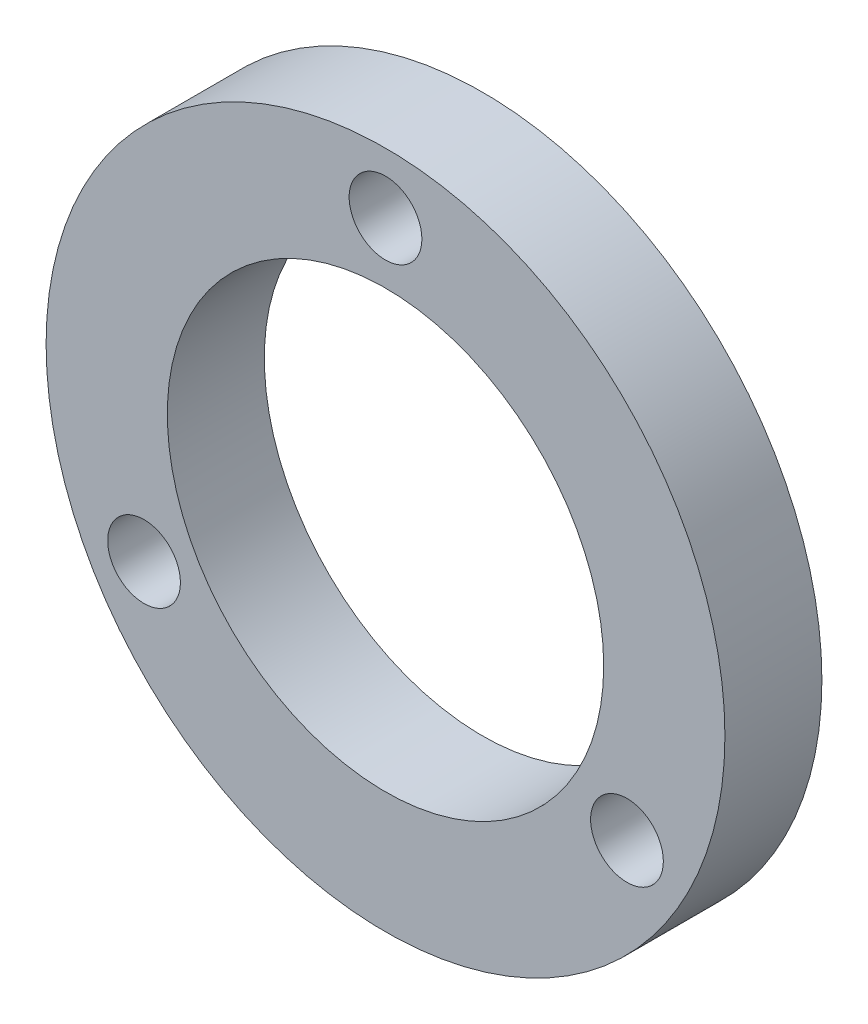
ISO-10303-21;
HEADER;
FILE_DESCRIPTION(('STEP AP214'),'2;1');
FILE_NAME('part.step','',(''),(''),'','','');
FILE_SCHEMA(('AUTOMOTIVE_DESIGN { 1 0 10303 214 1 1 1 1 }'));
ENDSEC;
DATA;
#1=APPLICATION_CONTEXT('core data for automotive mechanical design processes');
#2=APPLICATION_PROTOCOL_DEFINITION('international standard','automotive_design',2000,#1);
#3=PRODUCT_CONTEXT('',#1,'mechanical');
#4=PRODUCT('Part','Part','',(#3));
#5=PRODUCT_RELATED_PRODUCT_CATEGORY('part','',(#4));
#6=PRODUCT_DEFINITION_FORMATION('','',#4);
#7=PRODUCT_DEFINITION_CONTEXT('part definition',#1,'design');
#8=PRODUCT_DEFINITION('design','',#6,#7);
#9=PRODUCT_DEFINITION_SHAPE('','',#8);
#10=(LENGTH_UNIT() NAMED_UNIT(*) SI_UNIT(.MILLI.,.METRE.));
#11=(NAMED_UNIT(*) PLANE_ANGLE_UNIT() SI_UNIT($,.RADIAN.));
#12=(NAMED_UNIT(*) SI_UNIT($,.STERADIAN.) SOLID_ANGLE_UNIT());
#13=UNCERTAINTY_MEASURE_WITH_UNIT(LENGTH_MEASURE(1.E-05),#10,'distance_accuracy_value','');
#14=(GEOMETRIC_REPRESENTATION_CONTEXT(3) GLOBAL_UNCERTAINTY_ASSIGNED_CONTEXT((#13)) GLOBAL_UNIT_ASSIGNED_CONTEXT((#10,
#11,#12)) REPRESENTATION_CONTEXT('',''));
#15=CARTESIAN_POINT('',(0.,0.,0.));
#16=DIRECTION('',(0.,0.,1.));
#17=DIRECTION('',(1.,0.,0.));
#18=AXIS2_PLACEMENT_3D('',#15,#16,#17);
#19=CARTESIAN_POINT('',(4.97964607176114,-2.87499999999964,2.));
#20=DIRECTION('',(0.,0.,-1.));
#21=DIRECTION('',(-1.,0.,0.));
#22=AXIS2_PLACEMENT_3D('',#19,#20,#21);
#23=CYLINDRICAL_SURFACE('',#22,0.750000000000509);
#24=CARTESIAN_POINT('',(4.97964607176114,-2.87499999999964,2.));
#25=DIRECTION('',(0.,0.,1.));
#26=DIRECTION('',(1.,0.,0.));
#27=AXIS2_PLACEMENT_3D('',#24,#25,#26);
#28=CIRCLE('',#27,0.750000000000509);
#29=CARTESIAN_POINT('',(5.72964607176164,-2.87499999999964,2.));
#30=VERTEX_POINT('',#29);
#31=EDGE_CURVE('E41',#30,#30,#28,.T.);
#32=ORIENTED_EDGE('',*,*,#31,.T.);
#33=EDGE_LOOP('',(#32));
#34=FACE_BOUND('',#33,.T.);
#35=CARTESIAN_POINT('',(4.97964607176114,-2.87499999999964,0.));
#36=DIRECTION('',(0.,0.,1.));
#37=DIRECTION('',(1.,0.,0.));
#38=AXIS2_PLACEMENT_3D('',#35,#36,#37);
#39=CIRCLE('',#38,0.750000000000509);
#40=CARTESIAN_POINT('',(5.72964607176164,-2.87499999999964,0.));
#41=VERTEX_POINT('',#40);
#42=EDGE_CURVE('E58',#41,#41,#39,.T.);
#43=ORIENTED_EDGE('',*,*,#42,.F.);
#44=EDGE_LOOP('',(#43));
#45=FACE_BOUND('',#44,.T.);
#46=ADVANCED_FACE('F33',(#34,#45),#23,.F.);
#47=CARTESIAN_POINT('',(-4.97964607175991,-2.87500000000036,2.));
#48=DIRECTION('',(0.,0.,-1.));
#49=DIRECTION('',(-1.,0.,0.));
#50=AXIS2_PLACEMENT_3D('',#47,#48,#49);
#51=CYLINDRICAL_SURFACE('',#50,0.750000000000741);
#52=CARTESIAN_POINT('',(-4.97964607175991,-2.87500000000036,2.));
#53=DIRECTION('',(0.,0.,1.));
#54=DIRECTION('',(1.,0.,0.));
#55=AXIS2_PLACEMENT_3D('',#52,#53,#54);
#56=CIRCLE('',#55,0.750000000000741);
#57=CARTESIAN_POINT('',(-4.22964607175917,-2.87500000000036,2.));
#58=VERTEX_POINT('',#57);
#59=EDGE_CURVE('E46',#58,#58,#56,.T.);
#60=ORIENTED_EDGE('',*,*,#59,.T.);
#61=EDGE_LOOP('',(#60));
#62=FACE_BOUND('',#61,.T.);
#63=CARTESIAN_POINT('',(-4.97964607175991,-2.87500000000036,0.));
#64=DIRECTION('',(0.,0.,1.));
#65=DIRECTION('',(1.,0.,0.));
#66=AXIS2_PLACEMENT_3D('',#63,#64,#65);
#67=CIRCLE('',#66,0.750000000000741);
#68=CARTESIAN_POINT('',(-4.22964607175917,-2.87500000000036,0.));
#69=VERTEX_POINT('',#68);
#70=EDGE_CURVE('E56',#69,#69,#67,.T.);
#71=ORIENTED_EDGE('',*,*,#70,.F.);
#72=EDGE_LOOP('',(#71));
#73=FACE_BOUND('',#72,.T.);
#74=ADVANCED_FACE('F76',(#62,#73),#51,.F.);
#75=CARTESIAN_POINT('',(0.,5.75,2.));
#76=DIRECTION('',(0.,0.,-1.));
#77=DIRECTION('',(-1.,0.,0.));
#78=AXIS2_PLACEMENT_3D('',#75,#76,#77);
#79=CYLINDRICAL_SURFACE('',#78,0.75);
#80=CARTESIAN_POINT('',(0.,5.75,2.));
#81=DIRECTION('',(0.,0.,1.));
#82=DIRECTION('',(1.,0.,0.));
#83=AXIS2_PLACEMENT_3D('',#80,#81,#82);
#84=CIRCLE('',#83,0.75);
#85=CARTESIAN_POINT('',(0.75,5.75,2.));
#86=VERTEX_POINT('',#85);
#87=EDGE_CURVE('E67',#86,#86,#84,.T.);
#88=ORIENTED_EDGE('',*,*,#87,.T.);
#89=EDGE_LOOP('',(#88));
#90=FACE_BOUND('',#89,.T.);
#91=CARTESIAN_POINT('',(0.,5.75,0.));
#92=DIRECTION('',(0.,0.,1.));
#93=DIRECTION('',(1.,0.,0.));
#94=AXIS2_PLACEMENT_3D('',#91,#92,#93);
#95=CIRCLE('',#94,0.75);
#96=CARTESIAN_POINT('',(0.75,5.75,0.));
#97=VERTEX_POINT('',#96);
#98=EDGE_CURVE('E53',#97,#97,#95,.T.);
#99=ORIENTED_EDGE('',*,*,#98,.F.);
#100=EDGE_LOOP('',(#99));
#101=FACE_BOUND('',#100,.T.);
#102=ADVANCED_FACE('F94',(#90,#101),#79,.F.);
#103=CARTESIAN_POINT('',(0.,0.,2.));
#104=DIRECTION('',(0.,0.,-1.));
#105=DIRECTION('',(-1.,0.,0.));
#106=AXIS2_PLACEMENT_3D('',#103,#104,#105);
#107=CYLINDRICAL_SURFACE('',#106,7.);
#108=CARTESIAN_POINT('',(0.,0.,2.));
#109=DIRECTION('',(0.,0.,1.));
#110=DIRECTION('',(1.,0.,0.));
#111=AXIS2_PLACEMENT_3D('',#108,#109,#110);
#112=CIRCLE('',#111,7.);
#113=CARTESIAN_POINT('',(7.,0.,2.));
#114=VERTEX_POINT('',#113);
#115=EDGE_CURVE('E63',#114,#114,#112,.T.);
#116=ORIENTED_EDGE('',*,*,#115,.F.);
#117=EDGE_LOOP('',(#116));
#118=FACE_BOUND('',#117,.T.);
#119=CARTESIAN_POINT('',(0.,0.,0.));
#120=DIRECTION('',(0.,0.,1.));
#121=DIRECTION('',(1.,0.,0.));
#122=AXIS2_PLACEMENT_3D('',#119,#120,#121);
#123=CIRCLE('',#122,7.);
#124=CARTESIAN_POINT('',(7.,0.,0.));
#125=VERTEX_POINT('',#124);
#126=EDGE_CURVE('E50',#125,#125,#123,.T.);
#127=ORIENTED_EDGE('',*,*,#126,.T.);
#128=EDGE_LOOP('',(#127));
#129=FACE_BOUND('',#128,.T.);
#130=ADVANCED_FACE('F35',(#118,#129),#107,.T.);
#131=CARTESIAN_POINT('',(0.,0.,2.));
#132=DIRECTION('',(0.,0.,-1.));
#133=DIRECTION('',(-1.,0.,0.));
#134=AXIS2_PLACEMENT_3D('',#131,#132,#133);
#135=CYLINDRICAL_SURFACE('',#134,4.5);
#136=CARTESIAN_POINT('',(0.,0.,2.));
#137=DIRECTION('',(0.,0.,1.));
#138=DIRECTION('',(1.,0.,0.));
#139=AXIS2_PLACEMENT_3D('',#136,#137,#138);
#140=CIRCLE('',#139,4.5);
#141=CARTESIAN_POINT('',(4.5,0.,2.));
#142=VERTEX_POINT('',#141);
#143=EDGE_CURVE('E10',#142,#142,#140,.T.);
#144=ORIENTED_EDGE('',*,*,#143,.T.);
#145=EDGE_LOOP('',(#144));
#146=FACE_BOUND('',#145,.T.);
#147=CARTESIAN_POINT('',(0.,0.,0.));
#148=DIRECTION('',(0.,0.,1.));
#149=DIRECTION('',(1.,0.,0.));
#150=AXIS2_PLACEMENT_3D('',#147,#148,#149);
#151=CIRCLE('',#150,4.5);
#152=CARTESIAN_POINT('',(4.5,0.,0.));
#153=VERTEX_POINT('',#152);
#154=EDGE_CURVE('E37',#153,#153,#151,.T.);
#155=ORIENTED_EDGE('',*,*,#154,.F.);
#156=EDGE_LOOP('',(#155));
#157=FACE_BOUND('',#156,.T.);
#158=ADVANCED_FACE('F83',(#146,#157),#135,.F.);
#159=CARTESIAN_POINT('',(0.,0.,2.));
#160=DIRECTION('',(0.,0.,1.));
#161=DIRECTION('',(1.,0.,0.));
#162=AXIS2_PLACEMENT_3D('',#159,#160,#161);
#163=PLANE('',#162);
#164=ORIENTED_EDGE('',*,*,#115,.T.);
#165=EDGE_LOOP('',(#164));
#166=FACE_BOUND('',#165,.T.);
#167=ORIENTED_EDGE('',*,*,#87,.F.);
#168=EDGE_LOOP('',(#167));
#169=FACE_BOUND('',#168,.T.);
#170=ORIENTED_EDGE('',*,*,#59,.F.);
#171=EDGE_LOOP('',(#170));
#172=FACE_BOUND('',#171,.T.);
#173=ORIENTED_EDGE('',*,*,#31,.F.);
#174=EDGE_LOOP('',(#173));
#175=FACE_BOUND('',#174,.T.);
#176=ORIENTED_EDGE('',*,*,#143,.F.);
#177=EDGE_LOOP('',(#176));
#178=FACE_BOUND('',#177,.T.);
#179=ADVANCED_FACE('F79',(#166,#169,#172,#175,#178),#163,.T.);
#180=CARTESIAN_POINT('',(0.,0.,0.));
#181=DIRECTION('',(0.,0.,1.));
#182=DIRECTION('',(1.,0.,0.));
#183=AXIS2_PLACEMENT_3D('',#180,#181,#182);
#184=PLANE('',#183);
#185=ORIENTED_EDGE('',*,*,#126,.F.);
#186=EDGE_LOOP('',(#185));
#187=FACE_BOUND('',#186,.T.);
#188=ORIENTED_EDGE('',*,*,#98,.T.);
#189=EDGE_LOOP('',(#188));
#190=FACE_BOUND('',#189,.T.);
#191=ORIENTED_EDGE('',*,*,#70,.T.);
#192=EDGE_LOOP('',(#191));
#193=FACE_BOUND('',#192,.T.);
#194=ORIENTED_EDGE('',*,*,#42,.T.);
#195=EDGE_LOOP('',(#194));
#196=FACE_BOUND('',#195,.T.);
#197=ORIENTED_EDGE('',*,*,#154,.T.);
#198=EDGE_LOOP('',(#197));
#199=FACE_BOUND('',#198,.T.);
#200=ADVANCED_FACE('F82',(#187,#190,#193,#196,#199),#184,.F.);
#201=CLOSED_SHELL('',(#46,#74,#102,#130,#158,#179,#200));
#202=MANIFOLD_SOLID_BREP('B2',#201);
#203=ADVANCED_BREP_SHAPE_REPRESENTATION('',(#18,#202),#14);
#204=SHAPE_DEFINITION_REPRESENTATION(#9,#203);
ENDSEC;
END-ISO-10303-21;
